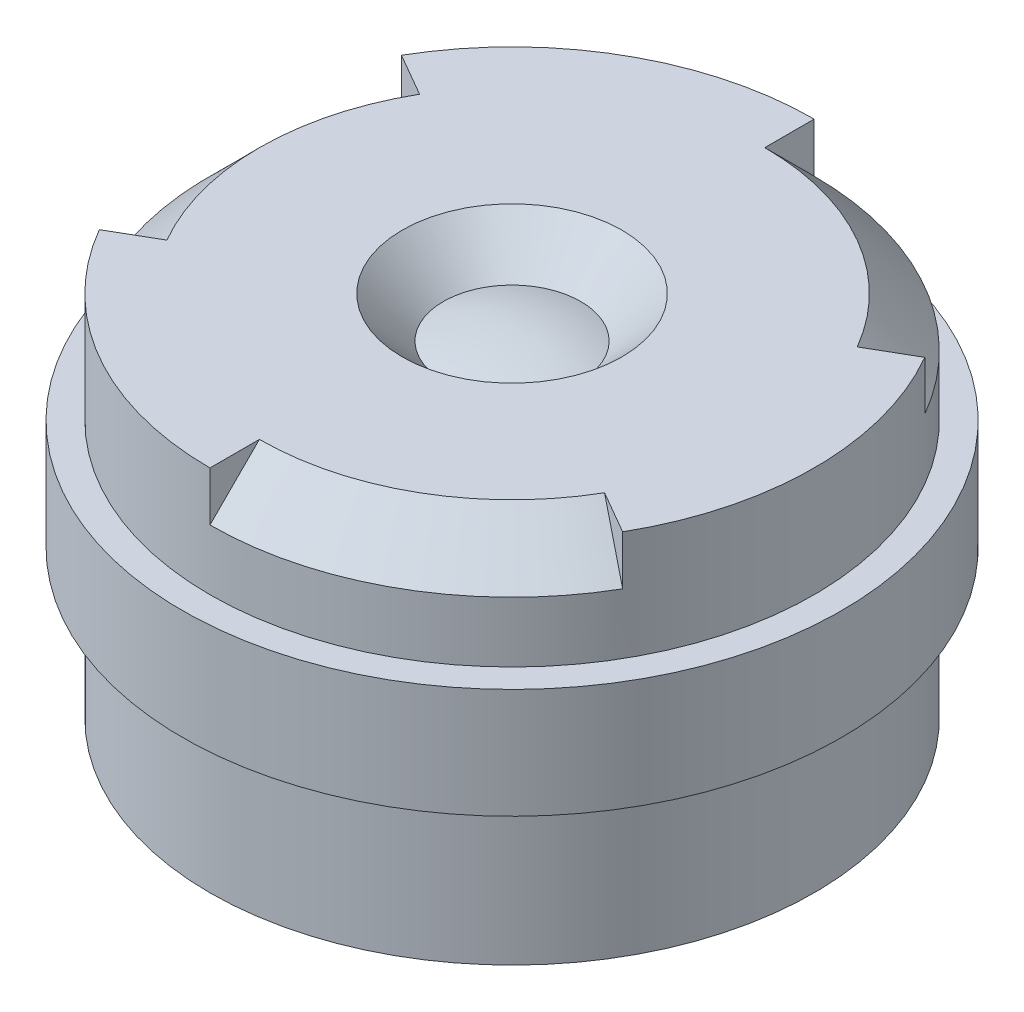
ISO-10303-21;
HEADER;
FILE_DESCRIPTION(('STEP AP214'),'2;1');
FILE_NAME('part.step','',(''),(''),'','','');
FILE_SCHEMA(('AUTOMOTIVE_DESIGN { 1 0 10303 214 1 1 1 1 }'));
ENDSEC;
DATA;
#1=APPLICATION_CONTEXT('core data for automotive mechanical design processes');
#2=APPLICATION_PROTOCOL_DEFINITION('international standard','automotive_design',2000,#1);
#3=PRODUCT_CONTEXT('',#1,'mechanical');
#4=PRODUCT('Part','Part','',(#3));
#5=PRODUCT_RELATED_PRODUCT_CATEGORY('part','',(#4));
#6=PRODUCT_DEFINITION_FORMATION('','',#4);
#7=PRODUCT_DEFINITION_CONTEXT('part definition',#1,'design');
#8=PRODUCT_DEFINITION('design','',#6,#7);
#9=PRODUCT_DEFINITION_SHAPE('','',#8);
#10=(LENGTH_UNIT() NAMED_UNIT(*) SI_UNIT(.MILLI.,.METRE.));
#11=(NAMED_UNIT(*) PLANE_ANGLE_UNIT() SI_UNIT($,.RADIAN.));
#12=(NAMED_UNIT(*) SI_UNIT($,.STERADIAN.) SOLID_ANGLE_UNIT());
#13=UNCERTAINTY_MEASURE_WITH_UNIT(LENGTH_MEASURE(1.E-05),#10,'distance_accuracy_value','');
#14=(GEOMETRIC_REPRESENTATION_CONTEXT(3) GLOBAL_UNCERTAINTY_ASSIGNED_CONTEXT((#13)) GLOBAL_UNIT_ASSIGNED_CONTEXT((#10,
#11,#12)) REPRESENTATION_CONTEXT('',''));
#15=CARTESIAN_POINT('',(0.,0.,0.));
#16=DIRECTION('',(0.,0.,1.));
#17=DIRECTION('',(1.,0.,0.));
#18=AXIS2_PLACEMENT_3D('',#15,#16,#17);
#19=CARTESIAN_POINT('',(0.,-1.478125,0.));
#20=DIRECTION('',(1.,0.,0.));
#21=DIRECTION('',(0.,1.,0.));
#22=AXIS2_PLACEMENT_3D('',#19,#20,#21);
#23=SPHERICAL_SURFACE('',#22,2.003125);
#24=CARTESIAN_POINT('',(0.,0.425000000007003,0.));
#25=DIRECTION('',(0.,1.,0.));
#26=DIRECTION('',(0.,0.,1.));
#27=AXIS2_PLACEMENT_3D('',#24,#25,#26);
#28=CIRCLE('',#27,0.624999999951232);
#29=CARTESIAN_POINT('',(0.,0.425000000007003,0.624999999951233));
#30=VERTEX_POINT('',#29);
#31=EDGE_CURVE('E20',#30,#30,#28,.T.);
#32=ORIENTED_EDGE('',*,*,#31,.T.);
#33=EDGE_LOOP('',(#32));
#34=FACE_BOUND('',#33,.T.);
#35=ADVANCED_FACE('F16',(#34),#23,.T.);
#36=CARTESIAN_POINT('',(0.,0.800000000083401,0.));
#37=DIRECTION('',(0.,1.,0.));
#38=DIRECTION('',(0.,0.,1.));
#39=AXIS2_PLACEMENT_3D('',#36,#37,#38);
#40=CONICAL_SURFACE('',#39,1.00000000005656,0.785398163436018);
#41=CARTESIAN_POINT('',(0.,0.800000000004002,0.));
#42=DIRECTION('',(0.,1.,0.));
#43=DIRECTION('',(0.,0.,1.));
#44=AXIS2_PLACEMENT_3D('',#41,#42,#43);
#45=CIRCLE('',#44,0.999999999977158);
#46=CARTESIAN_POINT('',(0.,0.800000000004002,0.999999999977158));
#47=VERTEX_POINT('',#46);
#48=EDGE_CURVE('E135',#47,#47,#45,.T.);
#49=ORIENTED_EDGE('',*,*,#48,.T.);
#50=EDGE_LOOP('',(#49));
#51=FACE_BOUND('',#50,.T.);
#52=ORIENTED_EDGE('',*,*,#31,.F.);
#53=EDGE_LOOP('',(#52));
#54=FACE_BOUND('',#53,.T.);
#55=ADVANCED_FACE('F351',(#51,#54),#40,.F.);
#56=CARTESIAN_POINT('',(0.,0.3473,2.52365));
#57=DIRECTION('',(1.,0.,0.));
#58=DIRECTION('',(0.,0.,-1.));
#59=AXIS2_PLACEMENT_3D('',#56,#57,#58);
#60=PLANE('',#59);
#61=DIRECTION('',(0.,1.,0.));
#62=VECTOR('',#61,1.);
#63=CARTESIAN_POINT('',(0.,0.3,2.75));
#64=LINE('',#63,#62);
#65=CARTESIAN_POINT('',(6.34163953950779E-12,0.349999999965545,2.74999999992148));
#66=VERTEX_POINT('',#65);
#67=CARTESIAN_POINT('',(0.,0.8,2.75));
#68=VERTEX_POINT('',#67);
#69=EDGE_CURVE('E199',#66,#68,#64,.T.);
#70=ORIENTED_EDGE('',*,*,#69,.F.);
#71=DIRECTION('',(-7.53669349151664E-12,0.707106781664877,-0.707106780708219));
#72=VECTOR('',#71,1.);
#73=CARTESIAN_POINT('',(5.31861133321854E-06,-499000.,499003.099324893));
#74=LINE('',#73,#72);
#75=CARTESIAN_POINT('',(3.55714906322443E-12,0.799999999977285,2.30000000030689));
#76=VERTEX_POINT('',#75);
#77=EDGE_CURVE('E134',#76,#66,#74,.F.);
#78=ORIENTED_EDGE('',*,*,#77,.F.);
#79=DIRECTION('',(0.,0.,-1.));
#80=VECTOR('',#79,1.);
#81=CARTESIAN_POINT('',(0.,0.8,0.));
#82=LINE('',#81,#80);
#83=EDGE_CURVE('E236',#76,#68,#82,.F.);
#84=ORIENTED_EDGE('',*,*,#83,.T.);
#85=EDGE_LOOP('',(#70,#78,#84));
#86=FACE_BOUND('',#85,.T.);
#87=ADVANCED_FACE('F324',(#86),#60,.T.);
#88=CARTESIAN_POINT('',(-2.18554501,0.3473,1.261825));
#89=DIRECTION('',(0.500000000280464,0.,0.866025403622513));
#90=DIRECTION('',(0.866025403622513,0.,-0.500000000280464));
#91=AXIS2_PLACEMENT_3D('',#88,#89,#90);
#92=PLANE('',#91);
#93=DIRECTION('',(0.866025403393868,0.,-0.500000000676488));
#94=VECTOR('',#93,1.);
#95=CARTESIAN_POINT('',(-2.3815698603054,0.8,1.37500000017634));
#96=LINE('',#95,#94);
#97=CARTESIAN_POINT('',(-2.3815698603054,0.8,1.37500000017634));
#98=VERTEX_POINT('',#97);
#99=CARTESIAN_POINT('',(-1.99185842902526,0.799999999984857,1.15000000001459));
#100=VERTEX_POINT('',#99);
#101=EDGE_CURVE('E84',#98,#100,#96,.T.);
#102=ORIENTED_EDGE('',*,*,#101,.T.);
#103=CARTESIAN_POINT('',(-2.38156985994454,0.35000000002583,1.37499999996798));
#104=CARTESIAN_POINT('',(-2.36533188366015,0.368750000051877,1.36562499996557));
#105=CARTESIAN_POINT('',(-2.34909390736651,0.387500000069702,1.35624999996272));
#106=CARTESIAN_POINT('',(-2.31661795479425,0.425000000067456,1.33749999996871));
#107=CARTESIAN_POINT('',(-2.30037997851563,0.443750000047386,1.32812499997756));
#108=CARTESIAN_POINT('',(-2.26790402594136,0.481250000023533,1.3093749999817));
#109=CARTESIAN_POINT('',(-2.25166604964573,0.500000000019751,1.299999999977));
#110=CARTESIAN_POINT('',(-2.21919009706267,0.537500000041928,1.28124999997497));
#111=CARTESIAN_POINT('',(-2.20295212077523,0.556250000067888,1.27187499997765));
#112=CARTESIAN_POINT('',(-2.17047616820735,0.593750000069692,1.25312499998466));
#113=CARTESIAN_POINT('',(-2.1542381919269,0.612500000045537,1.24374999998899));
#114=CARTESIAN_POINT('',(-2.12176223935413,0.650000000026175,1.22499999999954));
#115=CARTESIAN_POINT('',(-2.1055242630618,0.668750000030968,1.21562500000576));
#116=CARTESIAN_POINT('',(-2.07304831045683,0.706250000031081,1.19687499999725));
#117=CARTESIAN_POINT('',(-2.05681033414419,0.7250000000264,1.18749999998252));
#118=CARTESIAN_POINT('',(-2.02433438155064,0.762499999998091,1.16874999997397));
#119=CARTESIAN_POINT('',(-2.00809640526973,0.781249999974462,1.15937499998015));
#120=CARTESIAN_POINT('',(-1.99185842900205,0.799999999969714,1.15000000000118));
#121=B_SPLINE_CURVE_WITH_KNOTS('',3,(#103,#104,#105,#106,#107,#108,#109,#110,#111,#112,#113,
#114,#115,#116,#117,#118,#119,#120),.UNSPECIFIED.,.F.,.F.,(4,2,2,2,2,2,2,2,4),(0.,
0.0795495128741229,0.159099025627883,0.238648538461812,0.318198051335935,0.39774756408917,
0.477297076923624,0.556846589797527,0.636396102550761),.UNSPECIFIED.);
#122=CARTESIAN_POINT('',(-2.38156986018511,0.35000000000861,1.37500000010689));
#123=VERTEX_POINT('',#122);
#124=EDGE_CURVE('E95',#123,#100,#121,.T.);
#125=ORIENTED_EDGE('',*,*,#124,.F.);
#126=DIRECTION('',(0.,1.,0.));
#127=VECTOR('',#126,1.);
#128=CARTESIAN_POINT('',(-2.3815698603054,0.3,1.37500000017634));
#129=LINE('',#128,#127);
#130=EDGE_CURVE('E175',#98,#123,#129,.F.);
#131=ORIENTED_EDGE('',*,*,#130,.F.);
#132=EDGE_LOOP('',(#102,#125,#131));
#133=FACE_BOUND('',#132,.T.);
#134=ADVANCED_FACE('F325',(#133),#92,.F.);
#135=CARTESIAN_POINT('',(0.,0.349999999798456,0.));
#136=DIRECTION('',(0.,-1.,0.));
#137=DIRECTION('',(0.,0.,-1.));
#138=AXIS2_PLACEMENT_3D('',#135,#136,#137);
#139=CONICAL_SURFACE('',#138,2.74999999986819,0.785398162711261);
#140=ORIENTED_EDGE('',*,*,#124,.T.);
#141=CARTESIAN_POINT('',(0.,0.799999999969714,0.));
#142=DIRECTION('',(0.,-1.,0.));
#143=DIRECTION('',(0.,0.,-1.));
#144=AXIS2_PLACEMENT_3D('',#141,#142,#143);
#145=CIRCLE('',#144,2.3000000003145);
#146=CARTESIAN_POINT('',(-1.99185842877771,0.799999999984857,-1.15000000018721));
#147=VERTEX_POINT('',#146);
#148=EDGE_CURVE('E89',#100,#147,#145,.T.);
#149=ORIENTED_EDGE('',*,*,#148,.T.);
#150=DIRECTION('',(0.61237243558129,0.707106781186554,0.353553390791588));
#151=VECTOR('',#150,1.);
#152=CARTESIAN_POINT('',(-2.3815698603054,0.349999999999999,-1.37500000017632));
#153=LINE('',#152,#151);
#154=CARTESIAN_POINT('',(-2.38156986044114,0.349999999999999,-1.37499999994122));
#155=VERTEX_POINT('',#154);
#156=EDGE_CURVE('E93',#155,#147,#153,.T.);
#157=ORIENTED_EDGE('',*,*,#156,.F.);
#158=CARTESIAN_POINT('',(0.,0.35,0.));
#159=DIRECTION('',(0.,1.,0.));
#160=DIRECTION('',(0.,0.,1.));
#161=AXIS2_PLACEMENT_3D('',#158,#159,#160);
#162=CIRCLE('',#161,2.75);
#163=EDGE_CURVE('E169',#123,#155,#162,.F.);
#164=ORIENTED_EDGE('',*,*,#163,.F.);
#165=EDGE_LOOP('',(#140,#149,#157,#164));
#166=FACE_BOUND('',#165,.T.);
#167=ADVANCED_FACE('F91',(#166),#139,.T.);
#168=CARTESIAN_POINT('',(-2.18554501,0.3473,-1.261825));
#169=DIRECTION('',(-0.500000000280464,0.,0.866025403622513));
#170=DIRECTION('',(0.866025403622513,0.,0.500000000280464));
#171=AXIS2_PLACEMENT_3D('',#168,#169,#170);
#172=PLANE('',#171);
#173=DIRECTION('',(0.,1.,0.));
#174=VECTOR('',#173,1.);
#175=CARTESIAN_POINT('',(-2.38156986050901,0.3,-1.37499999982366));
#176=LINE('',#175,#174);
#177=CARTESIAN_POINT('',(-2.38156986040721,0.8,-1.37499999999999));
#178=VERTEX_POINT('',#177);
#179=EDGE_CURVE('E103',#155,#178,#176,.T.);
#180=ORIENTED_EDGE('',*,*,#179,.F.);
#181=ORIENTED_EDGE('',*,*,#156,.T.);
#182=DIRECTION('',(-0.866025403722525,0.,-0.500000000107237));
#183=VECTOR('',#182,1.);
#184=CARTESIAN_POINT('',(-1.99185842863027,0.8,-1.15000000012807));
#185=LINE('',#184,#183);
#186=EDGE_CURVE('E98',#147,#178,#185,.T.);
#187=ORIENTED_EDGE('',*,*,#186,.T.);
#188=EDGE_LOOP('',(#180,#181,#187));
#189=FACE_BOUND('',#188,.T.);
#190=ADVANCED_FACE('F100',(#189),#172,.T.);
#191=CARTESIAN_POINT('',(0.,0.3473,-2.52365));
#192=DIRECTION('',(-1.,0.,0.));
#193=DIRECTION('',(0.,0.,1.));
#194=AXIS2_PLACEMENT_3D('',#191,#192,#193);
#195=PLANE('',#194);
#196=DIRECTION('',(0.,0.,-1.));
#197=VECTOR('',#196,1.);
#198=CARTESIAN_POINT('',(-2.03571968310223E-10,0.8,0.));
#199=LINE('',#198,#197);
#200=CARTESIAN_POINT('',(-2.03571728797626E-10,0.8,-2.75));
#201=VERTEX_POINT('',#200);
#202=CARTESIAN_POINT('',(-1.01785984155112E-10,0.799999999984857,-2.30000000001092));
#203=VERTEX_POINT('',#202);
#204=EDGE_CURVE('E111',#201,#203,#199,.F.);
#205=ORIENTED_EDGE('',*,*,#204,.T.);
#206=CARTESIAN_POINT('',(2.03609663851356E-10,0.349999999968986,-2.74999999994761));
#207=CARTESIAN_POINT('',(1.92678539643864E-10,0.368749999978644,-2.7312499999659));
#208=CARTESIAN_POINT('',(1.96146495379229E-10,0.387499999974801,-2.71249999997068));
#209=CARTESIAN_POINT('',(1.99219466813995E-10,0.424999999986061,-2.67499999995379));
#210=CARTESIAN_POINT('',(1.98824482508716E-10,0.443750000001165,-2.65624999993211));
#211=CARTESIAN_POINT('',(1.61510473856046E-10,0.481250000003348,-2.61874999995575));
#212=CARTESIAN_POINT('',(1.24591449601201E-10,0.499999999990427,-2.60000000000107));
#213=CARTESIAN_POINT('',(9.42095866771919E-11,0.537499999995601,-2.56250000002769));
#214=CARTESIAN_POINT('',(1.0074674811814E-10,0.556250000013695,-2.543750000009));
#215=CARTESIAN_POINT('',(8.69944980603356E-11,0.593749999989372,-2.50625000000976));
#216=CARTESIAN_POINT('',(6.67050866321469E-11,0.612499999946955,-2.48750000002919));
#217=CARTESIAN_POINT('',(5.02880646241505E-11,0.649999999927559,-2.45000000003487));
#218=CARTESIAN_POINT('',(5.41604541078973E-11,0.668749999950579,-2.43125000002111));
#219=CARTESIAN_POINT('',(3.57397859306045E-11,0.706249999971346,-2.39375000000259));
#220=CARTESIAN_POINT('',(1.34467282934815E-11,0.724999999969092,-2.37499999999783));
#221=CARTESIAN_POINT('',(-1.54790262302321E-11,0.762499999964585,-2.33749999999944));
#222=CARTESIAN_POINT('',(-2.21117231214737E-11,0.781249999962331,-2.31875000000582));
#223=CARTESIAN_POINT('',(0.,0.799999999969714,-2.30000000002183));
#224=B_SPLINE_CURVE_WITH_KNOTS('',3,(#206,#207,#208,#209,#210,#211,#212,#213,#214,#215,#216,
#217,#218,#219,#220,#221,#222,#223),.UNSPECIFIED.,.F.,.F.,(4,2,2,2,2,2,2,2,4),(0.,
0.0795495128651771,0.159099025826692,0.238648538586639,0.318198051548154,0.397747564300425,
0.47729707726194,0.556846590150742,0.63639610301592),.UNSPECIFIED.);
#225=CARTESIAN_POINT('',(-6.78444266747437E-11,0.349999999989661,-2.74999999998253));
#226=VERTEX_POINT('',#225);
#227=EDGE_CURVE('E105',#226,#203,#224,.T.);
#228=ORIENTED_EDGE('',*,*,#227,.F.);
#229=DIRECTION('',(0.,1.,0.));
#230=VECTOR('',#229,1.);
#231=CARTESIAN_POINT('',(-2.03571489285028E-10,0.3,-2.75));
#232=LINE('',#231,#230);
#233=EDGE_CURVE('E142',#201,#226,#232,.F.);
#234=ORIENTED_EDGE('',*,*,#233,.F.);
#235=EDGE_LOOP('',(#205,#228,#234));
#236=FACE_BOUND('',#235,.T.);
#237=ADVANCED_FACE('F329',(#236),#195,.F.);
#238=CARTESIAN_POINT('',(0.,0.349999999968986,0.));
#239=DIRECTION('',(0.,-1.,0.));
#240=DIRECTION('',(0.,0.,-1.));
#241=AXIS2_PLACEMENT_3D('',#238,#239,#240);
#242=CONICAL_SURFACE('',#241,2.7499999999476,0.785398163314164);
#243=ORIENTED_EDGE('',*,*,#227,.T.);
#244=CARTESIAN_POINT('',(0.,0.799999999969714,0.));
#245=DIRECTION('',(0.,-1.,0.));
#246=DIRECTION('',(0.,0.,-1.));
#247=AXIS2_PLACEMENT_3D('',#244,#245,#246);
#248=CIRCLE('',#247,2.30000000002183);
#249=CARTESIAN_POINT('',(1.99185842874929,0.799999999969714,-1.14999999997403));
#250=VERTEX_POINT('',#249);
#251=EDGE_CURVE('E113',#203,#250,#248,.T.);
#252=ORIENTED_EDGE('',*,*,#251,.T.);
#253=DIRECTION('',(-0.612372435341349,0.707106781463614,0.353553390653059));
#254=VECTOR('',#253,1.);
#255=CARTESIAN_POINT('',(2.38156986,0.35,-1.375));
#256=LINE('',#255,#254);
#257=CARTESIAN_POINT('',(2.3815698602545,0.349999999941224,-1.37500000014694));
#258=VERTEX_POINT('',#257);
#259=EDGE_CURVE('E118',#258,#250,#256,.T.);
#260=ORIENTED_EDGE('',*,*,#259,.F.);
#261=CARTESIAN_POINT('',(0.,0.349999999999999,0.));
#262=DIRECTION('',(0.,1.,0.));
#263=DIRECTION('',(0.,0.,1.));
#264=AXIS2_PLACEMENT_3D('',#261,#262,#263);
#265=CIRCLE('',#264,2.75);
#266=EDGE_CURVE('E123',#226,#258,#265,.F.);
#267=ORIENTED_EDGE('',*,*,#266,.F.);
#268=EDGE_LOOP('',(#243,#252,#260,#267));
#269=FACE_BOUND('',#268,.T.);
#270=ADVANCED_FACE('F154',(#269),#242,.T.);
#271=CARTESIAN_POINT('',(2.18554501,0.3473,-1.261825));
#272=DIRECTION('',(-0.500000000280464,0.,-0.866025403622513));
#273=DIRECTION('',(-0.866025403622513,0.,0.500000000280464));
#274=AXIS2_PLACEMENT_3D('',#271,#272,#273);
#275=PLANE('',#274);
#276=DIRECTION('',(0.,1.,0.));
#277=VECTOR('',#276,1.);
#278=CARTESIAN_POINT('',(2.3815698603054,0.3,-1.37500000017633));
#279=LINE('',#278,#277);
#280=CARTESIAN_POINT('',(2.3815698603054,0.8,-1.37500000017633));
#281=VERTEX_POINT('',#280);
#282=EDGE_CURVE('E119',#258,#281,#279,.T.);
#283=ORIENTED_EDGE('',*,*,#282,.F.);
#284=ORIENTED_EDGE('',*,*,#259,.T.);
#285=DIRECTION('',(0.86602540339385,0.,-0.50000000067652));
#286=VECTOR('',#285,1.);
#287=CARTESIAN_POINT('',(1.99185842877817,0.8,-1.14999999987189));
#288=LINE('',#287,#286);
#289=EDGE_CURVE('E237',#250,#281,#288,.T.);
#290=ORIENTED_EDGE('',*,*,#289,.T.);
#291=EDGE_LOOP('',(#283,#284,#290));
#292=FACE_BOUND('',#291,.T.);
#293=ADVANCED_FACE('F152',(#292),#275,.T.);
#294=CARTESIAN_POINT('',(-2.41235928,0.8,0.));
#295=DIRECTION('',(0.,-1.,0.));
#296=DIRECTION('',(0.,0.,-1.));
#297=AXIS2_PLACEMENT_3D('',#294,#295,#296);
#298=PLANE('',#297);
#299=ORIENTED_EDGE('',*,*,#48,.F.);
#300=EDGE_LOOP('',(#299));
#301=FACE_BOUND('',#300,.T.);
#302=ORIENTED_EDGE('',*,*,#83,.F.);
#303=CARTESIAN_POINT('',(0.,0.799999999969714,0.));
#304=DIRECTION('',(0.,-1.,0.));
#305=DIRECTION('',(1.,0.,0.));
#306=AXIS2_PLACEMENT_3D('',#303,#304,#305);
#307=CIRCLE('',#306,2.30000000033847);
#308=CARTESIAN_POINT('',(1.9918584289842,0.799999999984857,1.15000000010968));
#309=VERTEX_POINT('',#308);
#310=EDGE_CURVE('E202',#309,#76,#307,.T.);
#311=ORIENTED_EDGE('',*,*,#310,.F.);
#312=DIRECTION('',(-0.866025403622513,0.,-0.500000000280464));
#313=VECTOR('',#312,1.);
#314=CARTESIAN_POINT('',(2.18554501,0.8,1.261825));
#315=LINE('',#314,#313);
#316=CARTESIAN_POINT('',(2.3815698604072,0.8,1.37500000000002));
#317=VERTEX_POINT('',#316);
#318=EDGE_CURVE('E132',#309,#317,#315,.F.);
#319=ORIENTED_EDGE('',*,*,#318,.T.);
#320=CARTESIAN_POINT('',(0.,0.8,0.));
#321=DIRECTION('',(0.,1.,0.));
#322=DIRECTION('',(0.,0.,1.));
#323=AXIS2_PLACEMENT_3D('',#320,#321,#322);
#324=CIRCLE('',#323,2.75);
#325=EDGE_CURVE('E122',#281,#317,#324,.F.);
#326=ORIENTED_EDGE('',*,*,#325,.F.);
#327=ORIENTED_EDGE('',*,*,#289,.F.);
#328=ORIENTED_EDGE('',*,*,#251,.F.);
#329=ORIENTED_EDGE('',*,*,#204,.F.);
#330=CARTESIAN_POINT('',(0.,0.8,0.));
#331=DIRECTION('',(0.,1.,0.));
#332=DIRECTION('',(0.,0.,1.));
#333=AXIS2_PLACEMENT_3D('',#330,#331,#332);
#334=CIRCLE('',#333,2.75);
#335=EDGE_CURVE('E110',#178,#201,#334,.F.);
#336=ORIENTED_EDGE('',*,*,#335,.F.);
#337=ORIENTED_EDGE('',*,*,#186,.F.);
#338=ORIENTED_EDGE('',*,*,#148,.F.);
#339=ORIENTED_EDGE('',*,*,#101,.F.);
#340=CARTESIAN_POINT('',(0.,0.8,0.));
#341=DIRECTION('',(0.,1.,0.));
#342=DIRECTION('',(0.,0.,1.));
#343=AXIS2_PLACEMENT_3D('',#340,#341,#342);
#344=CIRCLE('',#343,2.75);
#345=EDGE_CURVE('E196',#68,#98,#344,.F.);
#346=ORIENTED_EDGE('',*,*,#345,.F.);
#347=EDGE_LOOP('',(#302,#311,#319,#326,#327,#328,#329,#336,#337,#338,#339,#346));
#348=FACE_BOUND('',#347,.T.);
#349=ADVANCED_FACE('F108',(#301,#348),#298,.F.);
#350=CARTESIAN_POINT('',(2.18554501,0.3473,1.261825));
#351=DIRECTION('',(0.500000000280464,0.,-0.866025403622513));
#352=DIRECTION('',(-0.866025403622513,0.,-0.500000000280464));
#353=AXIS2_PLACEMENT_3D('',#350,#351,#352);
#354=PLANE('',#353);
#355=ORIENTED_EDGE('',*,*,#318,.F.);
#356=CARTESIAN_POINT('',(2.38156985998032,0.35000000002583,1.37499999998864));
#357=CARTESIAN_POINT('',(2.36533188367097,0.368750000034928,1.36562499998099));
#358=CARTESIAN_POINT('',(2.34909390737527,0.387500000058292,1.35624999997822));
#359=CARTESIAN_POINT('',(2.31661795482114,0.425000000067125,1.3374999999928));
#360=CARTESIAN_POINT('',(2.30037997856271,0.443750000052594,1.32812500001014));
#361=CARTESIAN_POINT('',(2.26790402599707,0.481250000030067,1.30937500001982));
#362=CARTESIAN_POINT('',(2.25166604968986,0.500000000022071,1.30000000001217));
#363=CARTESIAN_POINT('',(2.21919009708524,0.537500000039608,1.28125000000905));
#364=CARTESIAN_POINT('',(2.20295212078784,0.55625000006514,1.27187500001358));
#365=CARTESIAN_POINT('',(2.17047616821769,0.593750000069478,1.2531250000123));
#366=CARTESIAN_POINT('',(2.15423819194494,0.612500000048283,1.24375000000649));
#367=CARTESIAN_POINT('',(2.12176223936607,0.650000000026268,1.22500000000548));
#368=CARTESIAN_POINT('',(2.10552426305996,0.668750000025447,1.21562500001029));
#369=CARTESIAN_POINT('',(2.0730483104627,0.706250000025377,1.19687500000482));
#370=CARTESIAN_POINT('',(2.05681033417155,0.725000000026126,1.18749999999454));
#371=CARTESIAN_POINT('',(2.02433438160005,0.762500000008678,1.16874999998991));
#372=CARTESIAN_POINT('',(2.00809640531971,0.78124999999048,1.15937499999555));
#373=CARTESIAN_POINT('',(1.99185842902781,0.799999999969714,1.15000000001606));
#374=B_SPLINE_CURVE_WITH_KNOTS('',3,(#356,#357,#358,#359,#360,#361,#362,#363,#364,#365,#366,
#367,#368,#369,#370,#371,#372,#373),.UNSPECIFIED.,.F.,.F.,(4,2,2,2,2,2,2,2,4),(0.,
0.0795495128895764,0.159099025608976,0.238648538458359,0.318198051347935,0.397747564104054,
0.477297076953436,0.556846589794644,0.636396102558938),.UNSPECIFIED.);
#375=CARTESIAN_POINT('',(2.38156986028187,0.349999999951987,1.37499999996684));
#376=VERTEX_POINT('',#375);
#377=EDGE_CURVE('E35',#376,#309,#374,.T.);
#378=ORIENTED_EDGE('',*,*,#377,.F.);
#379=DIRECTION('',(0.,1.,0.));
#380=VECTOR('',#379,1.);
#381=CARTESIAN_POINT('',(2.38156986050899,0.3,1.37499999982371));
#382=LINE('',#381,#380);
#383=EDGE_CURVE('E126',#317,#376,#382,.F.);
#384=ORIENTED_EDGE('',*,*,#383,.F.);
#385=EDGE_LOOP('',(#355,#378,#384));
#386=FACE_BOUND('',#385,.T.);
#387=ADVANCED_FACE('F319',(#386),#354,.F.);
#388=CARTESIAN_POINT('',(0.,0.350000000025829,0.));
#389=DIRECTION('',(0.,-1.,0.));
#390=DIRECTION('',(1.,0.,0.));
#391=AXIS2_PLACEMENT_3D('',#388,#389,#390);
#392=CONICAL_SURFACE('',#391,2.74999999962462,0.785398162666629);
#393=ORIENTED_EDGE('',*,*,#377,.T.);
#394=ORIENTED_EDGE('',*,*,#310,.T.);
#395=ORIENTED_EDGE('',*,*,#77,.T.);
#396=CARTESIAN_POINT('',(0.,0.35,0.));
#397=DIRECTION('',(0.,1.,0.));
#398=DIRECTION('',(0.,0.,1.));
#399=AXIS2_PLACEMENT_3D('',#396,#397,#398);
#400=CIRCLE('',#399,2.75);
#401=EDGE_CURVE('E129',#376,#66,#400,.F.);
#402=ORIENTED_EDGE('',*,*,#401,.F.);
#403=EDGE_LOOP('',(#393,#394,#395,#402));
#404=FACE_BOUND('',#403,.T.);
#405=ADVANCED_FACE('F230',(#404),#392,.T.);
#406=CARTESIAN_POINT('',(0.,0.3,0.));
#407=DIRECTION('',(0.,1.,0.));
#408=DIRECTION('',(0.,0.,1.));
#409=AXIS2_PLACEMENT_3D('',#406,#407,#408);
#410=CYLINDRICAL_SURFACE('',#409,2.75);
#411=CARTESIAN_POINT('',(0.,-0.2,0.));
#412=DIRECTION('',(0.,1.,0.));
#413=DIRECTION('',(0.,0.,1.));
#414=AXIS2_PLACEMENT_3D('',#411,#412,#413);
#415=CIRCLE('',#414,2.75);
#416=CARTESIAN_POINT('',(0.,-0.2,2.75));
#417=VERTEX_POINT('',#416);
#418=EDGE_CURVE('E211',#417,#417,#415,.F.);
#419=ORIENTED_EDGE('',*,*,#418,.F.);
#420=EDGE_LOOP('',(#419));
#421=FACE_BOUND('',#420,.T.);
#422=ORIENTED_EDGE('',*,*,#383,.T.);
#423=ORIENTED_EDGE('',*,*,#401,.T.);
#424=ORIENTED_EDGE('',*,*,#69,.T.);
#425=ORIENTED_EDGE('',*,*,#345,.T.);
#426=ORIENTED_EDGE('',*,*,#130,.T.);
#427=ORIENTED_EDGE('',*,*,#163,.T.);
#428=ORIENTED_EDGE('',*,*,#179,.T.);
#429=ORIENTED_EDGE('',*,*,#335,.T.);
#430=ORIENTED_EDGE('',*,*,#233,.T.);
#431=ORIENTED_EDGE('',*,*,#266,.T.);
#432=ORIENTED_EDGE('',*,*,#282,.T.);
#433=ORIENTED_EDGE('',*,*,#325,.T.);
#434=EDGE_LOOP('',(#422,#423,#424,#425,#426,#427,#428,#429,#430,#431,#432,#433));
#435=FACE_BOUND('',#434,.T.);
#436=ADVANCED_FACE('F228',(#421,#435),#410,.T.);
#437=CARTESIAN_POINT('',(0.,3.,0.));
#438=DIRECTION('',(1.,0.,0.));
#439=DIRECTION('',(0.,1.,0.));
#440=AXIS2_PLACEMENT_3D('',#437,#438,#439);
#441=SPHERICAL_SURFACE('',#440,5.55);
#442=CARTESIAN_POINT('',(0.,-2.25000000006048,0.));
#443=DIRECTION('',(0.,-1.,0.));
#444=DIRECTION('',(1.,0.,0.));
#445=AXIS2_PLACEMENT_3D('',#442,#443,#444);
#446=CIRCLE('',#445,1.80000000003326);
#447=CARTESIAN_POINT('',(1.80000000003326,-2.25000000006048,0.));
#448=VERTEX_POINT('',#447);
#449=EDGE_CURVE('E258',#448,#448,#446,.T.);
#450=ORIENTED_EDGE('',*,*,#449,.T.);
#451=EDGE_LOOP('',(#450));
#452=FACE_BOUND('',#451,.T.);
#453=ADVANCED_FACE('F305',(#452),#441,.T.);
#454=CARTESIAN_POINT('',(-3.036,-0.2,0.));
#455=DIRECTION('',(0.,1.,0.));
#456=DIRECTION('',(0.,0.,1.));
#457=AXIS2_PLACEMENT_3D('',#454,#455,#456);
#458=PLANE('',#457);
#459=ORIENTED_EDGE('',*,*,#418,.T.);
#460=EDGE_LOOP('',(#459));
#461=FACE_BOUND('',#460,.T.);
#462=CARTESIAN_POINT('',(0.,-0.2,0.));
#463=DIRECTION('',(0.,-1.,0.));
#464=DIRECTION('',(0.,0.,-1.));
#465=AXIS2_PLACEMENT_3D('',#462,#463,#464);
#466=CIRCLE('',#465,3.);
#467=CARTESIAN_POINT('',(0.,-0.2,-3.));
#468=VERTEX_POINT('',#467);
#469=EDGE_CURVE('E261',#468,#468,#466,.T.);
#470=ORIENTED_EDGE('',*,*,#469,.F.);
#471=EDGE_LOOP('',(#470));
#472=FACE_BOUND('',#471,.T.);
#473=ADVANCED_FACE('F303',(#461,#472),#458,.T.);
#474=CARTESIAN_POINT('',(0.,-2.55000000004202,0.));
#475=DIRECTION('',(0.,-1.,0.));
#476=DIRECTION('',(1.,0.,0.));
#477=AXIS2_PLACEMENT_3D('',#474,#475,#476);
#478=CONICAL_SURFACE('',#477,2.09999999998797,0.78539816335273);
#479=ORIENTED_EDGE('',*,*,#449,.F.);
#480=EDGE_LOOP('',(#479));
#481=FACE_BOUND('',#480,.T.);
#482=CARTESIAN_POINT('',(0.,-2.55000000004202,0.));
#483=DIRECTION('',(0.,-1.,0.));
#484=DIRECTION('',(1.,0.,0.));
#485=AXIS2_PLACEMENT_3D('',#482,#483,#484);
#486=CIRCLE('',#485,2.09999999998797);
#487=CARTESIAN_POINT('',(2.09999999998796,-2.55000000004202,0.));
#488=VERTEX_POINT('',#487);
#489=EDGE_CURVE('E264',#488,#488,#486,.T.);
#490=ORIENTED_EDGE('',*,*,#489,.T.);
#491=EDGE_LOOP('',(#490));
#492=FACE_BOUND('',#491,.T.);
#493=ADVANCED_FACE('F288',(#481,#492),#478,.F.);
#494=CARTESIAN_POINT('',(0.,-0.7,0.));
#495=DIRECTION('',(0.,-1.,0.));
#496=DIRECTION('',(0.,0.,-1.));
#497=AXIS2_PLACEMENT_3D('',#494,#495,#496);
#498=CYLINDRICAL_SURFACE('',#497,3.);
#499=CARTESIAN_POINT('',(0.,-1.2,0.));
#500=DIRECTION('',(0.,-1.,0.));
#501=DIRECTION('',(0.,0.,-1.));
#502=AXIS2_PLACEMENT_3D('',#499,#500,#501);
#503=CIRCLE('',#502,3.);
#504=CARTESIAN_POINT('',(0.,-1.2,-3.));
#505=VERTEX_POINT('',#504);
#506=EDGE_CURVE('E267',#505,#505,#503,.T.);
#507=ORIENTED_EDGE('',*,*,#506,.F.);
#508=EDGE_LOOP('',(#507));
#509=FACE_BOUND('',#508,.T.);
#510=ORIENTED_EDGE('',*,*,#469,.T.);
#511=EDGE_LOOP('',(#510));
#512=FACE_BOUND('',#511,.T.);
#513=ADVANCED_FACE('F278',(#509,#512),#498,.T.);
#514=CARTESIAN_POINT('',(-2.783,-2.55,0.));
#515=DIRECTION('',(0.,1.,0.));
#516=DIRECTION('',(0.,0.,1.));
#517=AXIS2_PLACEMENT_3D('',#514,#515,#516);
#518=PLANE('',#517);
#519=ORIENTED_EDGE('',*,*,#489,.F.);
#520=EDGE_LOOP('',(#519));
#521=FACE_BOUND('',#520,.T.);
#522=CARTESIAN_POINT('',(0.,-2.55,0.));
#523=DIRECTION('',(0.,1.,0.));
#524=DIRECTION('',(0.,0.,1.));
#525=AXIS2_PLACEMENT_3D('',#522,#523,#524);
#526=CIRCLE('',#525,2.75);
#527=CARTESIAN_POINT('',(0.,-2.55,2.75));
#528=VERTEX_POINT('',#527);
#529=EDGE_CURVE('E26',#528,#528,#526,.T.);
#530=ORIENTED_EDGE('',*,*,#529,.F.);
#531=EDGE_LOOP('',(#530));
#532=FACE_BOUND('',#531,.T.);
#533=ADVANCED_FACE('F275',(#521,#532),#518,.F.);
#534=CARTESIAN_POINT('',(-3.036,-1.2,0.));
#535=DIRECTION('',(0.,-1.,0.));
#536=DIRECTION('',(0.,0.,-1.));
#537=AXIS2_PLACEMENT_3D('',#534,#535,#536);
#538=PLANE('',#537);
#539=CARTESIAN_POINT('',(0.,-1.2,0.));
#540=DIRECTION('',(0.,1.,0.));
#541=DIRECTION('',(0.,0.,1.));
#542=AXIS2_PLACEMENT_3D('',#539,#540,#541);
#543=CIRCLE('',#542,2.75);
#544=CARTESIAN_POINT('',(0.,-1.2,2.75));
#545=VERTEX_POINT('',#544);
#546=EDGE_CURVE('E11',#545,#545,#543,.F.);
#547=ORIENTED_EDGE('',*,*,#546,.F.);
#548=EDGE_LOOP('',(#547));
#549=FACE_BOUND('',#548,.T.);
#550=ORIENTED_EDGE('',*,*,#506,.T.);
#551=EDGE_LOOP('',(#550));
#552=FACE_BOUND('',#551,.T.);
#553=ADVANCED_FACE('F277',(#549,#552),#538,.T.);
#554=CARTESIAN_POINT('',(0.,-1.875,0.));
#555=DIRECTION('',(0.,1.,0.));
#556=DIRECTION('',(0.,0.,1.));
#557=AXIS2_PLACEMENT_3D('',#554,#555,#556);
#558=CYLINDRICAL_SURFACE('',#557,2.75);
#559=ORIENTED_EDGE('',*,*,#546,.T.);
#560=EDGE_LOOP('',(#559));
#561=FACE_BOUND('',#560,.T.);
#562=ORIENTED_EDGE('',*,*,#529,.T.);
#563=EDGE_LOOP('',(#562));
#564=FACE_BOUND('',#563,.T.);
#565=ADVANCED_FACE('F273',(#561,#564),#558,.T.);
#566=CLOSED_SHELL('',(#35,#55,#87,#134,#167,#190,#237,#270,#293,#349,#387,#405,#436,#453,#473,
#493,#513,#533,#553,#565));
#567=MANIFOLD_SOLID_BREP('B1',#566);
#568=ADVANCED_BREP_SHAPE_REPRESENTATION('',(#18,#567),#14);
#569=SHAPE_DEFINITION_REPRESENTATION(#9,#568);
ENDSEC;
END-ISO-10303-21;
